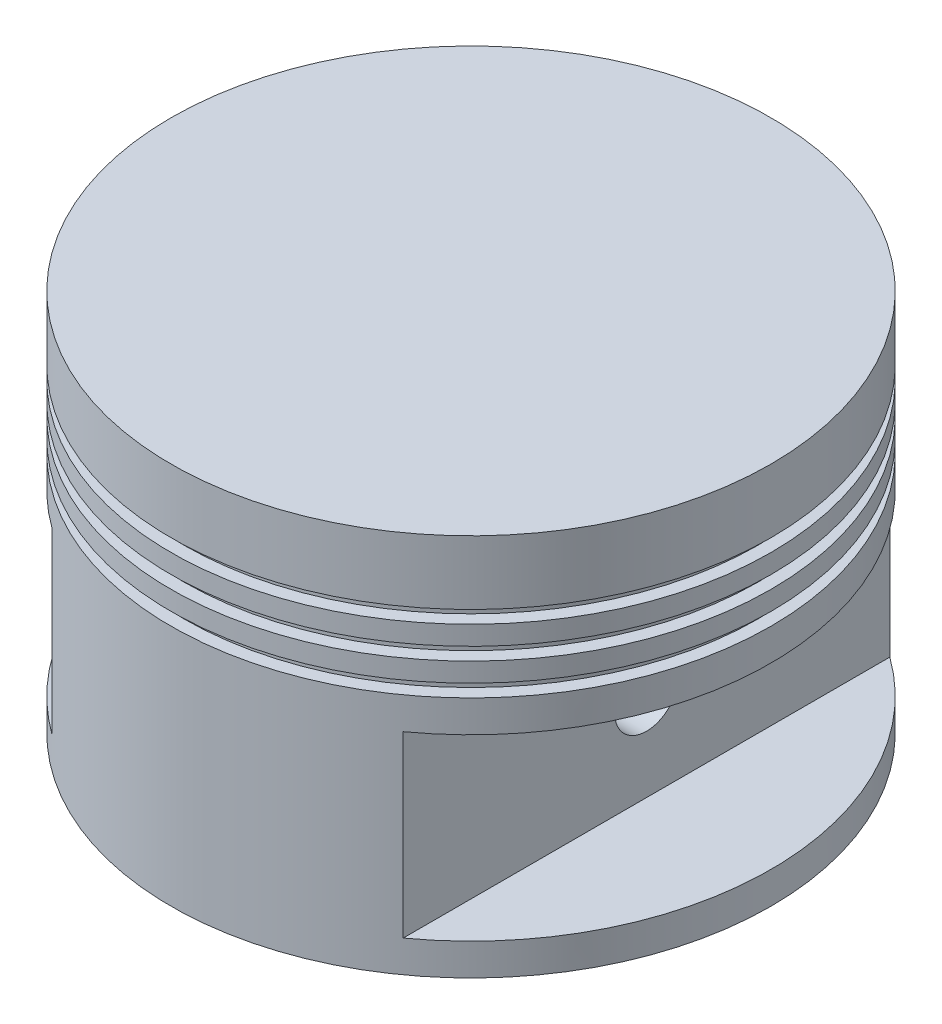
ISO-10303-21;
HEADER;
FILE_DESCRIPTION(('STEP AP214'),'2;1');
FILE_NAME('part.step','',(''),(''),'','','');
FILE_SCHEMA(('AUTOMOTIVE_DESIGN { 1 0 10303 214 1 1 1 1 }'));
ENDSEC;
DATA;
#1=APPLICATION_CONTEXT('core data for automotive mechanical design processes');
#2=APPLICATION_PROTOCOL_DEFINITION('international standard','automotive_design',2000,#1);
#3=PRODUCT_CONTEXT('',#1,'mechanical');
#4=PRODUCT('Part','Part','',(#3));
#5=PRODUCT_RELATED_PRODUCT_CATEGORY('part','',(#4));
#6=PRODUCT_DEFINITION_FORMATION('','',#4);
#7=PRODUCT_DEFINITION_CONTEXT('part definition',#1,'design');
#8=PRODUCT_DEFINITION('design','',#6,#7);
#9=PRODUCT_DEFINITION_SHAPE('','',#8);
#10=(LENGTH_UNIT() NAMED_UNIT(*) SI_UNIT(.MILLI.,.METRE.));
#11=(NAMED_UNIT(*) PLANE_ANGLE_UNIT() SI_UNIT($,.RADIAN.));
#12=(NAMED_UNIT(*) SI_UNIT($,.STERADIAN.) SOLID_ANGLE_UNIT());
#13=UNCERTAINTY_MEASURE_WITH_UNIT(LENGTH_MEASURE(1.E-05),#10,'distance_accuracy_value','');
#14=(GEOMETRIC_REPRESENTATION_CONTEXT(3) GLOBAL_UNCERTAINTY_ASSIGNED_CONTEXT((#13)) GLOBAL_UNIT_ASSIGNED_CONTEXT((#10,
#11,#12)) REPRESENTATION_CONTEXT('',''));
#15=CARTESIAN_POINT('',(0.,0.,0.));
#16=DIRECTION('',(0.,0.,1.));
#17=DIRECTION('',(1.,0.,0.));
#18=AXIS2_PLACEMENT_3D('',#15,#16,#17);
#19=CARTESIAN_POINT('',(17.5,0.,-47.));
#20=DIRECTION('',(-1.,0.,0.));
#21=DIRECTION('',(0.,-1.,0.));
#22=AXIS2_PLACEMENT_3D('',#19,#20,#21);
#23=PLANE('',#22);
#24=CARTESIAN_POINT('',(17.5,-41.,0.));
#25=DIRECTION('',(-1.,0.,0.));
#26=DIRECTION('',(0.,-1.,0.));
#27=AXIS2_PLACEMENT_3D('',#24,#25,#26);
#28=CIRCLE('',#27,5.);
#29=CARTESIAN_POINT('',(17.5,-46.,0.));
#30=VERTEX_POINT('',#29);
#31=EDGE_CURVE('E148',#30,#30,#28,.T.);
#32=ORIENTED_EDGE('',*,*,#31,.F.);
#33=EDGE_LOOP('',(#32));
#34=FACE_BOUND('',#33,.T.);
#35=DIRECTION('',(0.,1.,0.));
#36=VECTOR('',#35,1.);
#37=CARTESIAN_POINT('',(17.5,0.,30.3108891324554));
#38=LINE('',#37,#36);
#39=CARTESIAN_POINT('',(17.5,-32.,30.3108891324554));
#40=VERTEX_POINT('',#39);
#41=CARTESIAN_POINT('',(17.5,-18.,30.3108891324554));
#42=VERTEX_POINT('',#41);
#43=EDGE_CURVE('E190',#40,#42,#38,.T.);
#44=ORIENTED_EDGE('',*,*,#43,.T.);
#45=DIRECTION('',(0.,0.,-1.));
#46=VECTOR('',#45,1.);
#47=CARTESIAN_POINT('',(17.5,-18.,-47.));
#48=LINE('',#47,#46);
#49=CARTESIAN_POINT('',(17.5,-18.,-30.3108891324554));
#50=VERTEX_POINT('',#49);
#51=EDGE_CURVE('E56',#42,#50,#48,.T.);
#52=ORIENTED_EDGE('',*,*,#51,.T.);
#53=DIRECTION('',(0.,1.,0.));
#54=VECTOR('',#53,1.);
#55=CARTESIAN_POINT('',(17.5,0.,-30.3108891324554));
#56=LINE('',#55,#54);
#57=CARTESIAN_POINT('',(17.5,-32.,-30.3108891324554));
#58=VERTEX_POINT('',#57);
#59=EDGE_CURVE('E144',#50,#58,#56,.F.);
#60=ORIENTED_EDGE('',*,*,#59,.T.);
#61=DIRECTION('',(0.,0.,1.));
#62=VECTOR('',#61,1.);
#63=CARTESIAN_POINT('',(17.5,-32.,0.));
#64=LINE('',#63,#62);
#65=CARTESIAN_POINT('',(17.5,-32.,-32.5998466254061));
#66=VERTEX_POINT('',#65);
#67=EDGE_CURVE('E183',#66,#58,#64,.T.);
#68=ORIENTED_EDGE('',*,*,#67,.F.);
#69=DIRECTION('',(0.,1.,0.));
#70=VECTOR('',#69,1.);
#71=CARTESIAN_POINT('',(17.5,-65.,-32.5998466254061));
#72=LINE('',#71,#70);
#73=CARTESIAN_POINT('',(17.5,-60.,-32.5998466254061));
#74=VERTEX_POINT('',#73);
#75=EDGE_CURVE('E160',#74,#66,#72,.T.);
#76=ORIENTED_EDGE('',*,*,#75,.F.);
#77=DIRECTION('',(0.,0.,-1.));
#78=VECTOR('',#77,1.);
#79=CARTESIAN_POINT('',(17.5,-60.,-47.));
#80=LINE('',#79,#78);
#81=CARTESIAN_POINT('',(17.5,-60.,32.5998466254061));
#82=VERTEX_POINT('',#81);
#83=EDGE_CURVE('E139',#82,#74,#80,.T.);
#84=ORIENTED_EDGE('',*,*,#83,.F.);
#85=DIRECTION('',(0.,1.,0.));
#86=VECTOR('',#85,1.);
#87=CARTESIAN_POINT('',(17.5,-17.,32.5998466254061));
#88=LINE('',#87,#86);
#89=CARTESIAN_POINT('',(17.5,-32.,32.5998466254061));
#90=VERTEX_POINT('',#89);
#91=EDGE_CURVE('E156',#90,#82,#88,.F.);
#92=ORIENTED_EDGE('',*,*,#91,.F.);
#93=EDGE_CURVE('E181',#40,#90,#64,.T.);
#94=ORIENTED_EDGE('',*,*,#93,.F.);
#95=EDGE_LOOP('',(#44,#52,#60,#68,#76,#84,#92,#94));
#96=FACE_BOUND('',#95,.T.);
#97=ADVANCED_FACE('F40',(#34,#96),#23,.T.);
#98=CARTESIAN_POINT('',(0.,0.,0.));
#99=DIRECTION('',(0.,1.,0.));
#100=DIRECTION('',(-1.,0.,0.));
#101=AXIS2_PLACEMENT_3D('',#98,#99,#100);
#102=CYLINDRICAL_SURFACE('',#101,35.);
#103=CARTESIAN_POINT('',(0.,-18.,0.));
#104=DIRECTION('',(0.,1.,0.));
#105=DIRECTION('',(-1.,0.,0.));
#106=AXIS2_PLACEMENT_3D('',#103,#104,#105);
#107=CIRCLE('',#106,35.);
#108=CARTESIAN_POINT('',(-17.5,-18.,-30.3108891324553));
#109=VERTEX_POINT('',#108);
#110=EDGE_CURVE('E142',#109,#50,#107,.F.);
#111=ORIENTED_EDGE('',*,*,#110,.F.);
#112=DIRECTION('',(0.,1.,0.));
#113=VECTOR('',#112,1.);
#114=CARTESIAN_POINT('',(-17.5,0.,-30.3108891324553));
#115=LINE('',#114,#113);
#116=CARTESIAN_POINT('',(-17.5,-32.,-30.3108891324553));
#117=VERTEX_POINT('',#116);
#118=EDGE_CURVE('E130',#109,#117,#115,.F.);
#119=ORIENTED_EDGE('',*,*,#118,.T.);
#120=CARTESIAN_POINT('',(0.,-32.,0.));
#121=DIRECTION('',(0.,1.,0.));
#122=DIRECTION('',(-1.,0.,0.));
#123=AXIS2_PLACEMENT_3D('',#120,#121,#122);
#124=CIRCLE('',#123,35.);
#125=EDGE_CURVE('E171',#58,#117,#124,.T.);
#126=ORIENTED_EDGE('',*,*,#125,.F.);
#127=ORIENTED_EDGE('',*,*,#59,.F.);
#128=EDGE_LOOP('',(#111,#119,#126,#127));
#129=FACE_BOUND('',#128,.T.);
#130=ADVANCED_FACE('F143',(#129),#102,.F.);
#131=CARTESIAN_POINT('',(-17.5,-18.,30.3108891324553));
#132=VERTEX_POINT('',#131);
#133=EDGE_CURVE('E64',#42,#132,#107,.F.);
#134=ORIENTED_EDGE('',*,*,#133,.F.);
#135=ORIENTED_EDGE('',*,*,#43,.F.);
#136=CARTESIAN_POINT('',(-17.5,-32.,30.3108891324553));
#137=VERTEX_POINT('',#136);
#138=EDGE_CURVE('E174',#137,#40,#124,.T.);
#139=ORIENTED_EDGE('',*,*,#138,.F.);
#140=DIRECTION('',(0.,1.,0.));
#141=VECTOR('',#140,1.);
#142=CARTESIAN_POINT('',(-17.5,0.,30.3108891324553));
#143=LINE('',#142,#141);
#144=EDGE_CURVE('E138',#137,#132,#143,.T.);
#145=ORIENTED_EDGE('',*,*,#144,.T.);
#146=EDGE_LOOP('',(#134,#135,#139,#145));
#147=FACE_BOUND('',#146,.T.);
#148=ADVANCED_FACE('F297',(#147),#102,.F.);
#149=CARTESIAN_POINT('',(-17.5,0.,-47.));
#150=DIRECTION('',(-1.,0.,0.));
#151=DIRECTION('',(0.,-1.,0.));
#152=AXIS2_PLACEMENT_3D('',#149,#150,#151);
#153=PLANE('',#152);
#154=CARTESIAN_POINT('',(-17.5,-41.,0.));
#155=DIRECTION('',(-1.,0.,0.));
#156=DIRECTION('',(0.,-1.,0.));
#157=AXIS2_PLACEMENT_3D('',#154,#155,#156);
#158=CIRCLE('',#157,5.);
#159=CARTESIAN_POINT('',(-17.5,-46.,0.));
#160=VERTEX_POINT('',#159);
#161=EDGE_CURVE('E150',#160,#160,#158,.T.);
#162=ORIENTED_EDGE('',*,*,#161,.T.);
#163=EDGE_LOOP('',(#162));
#164=FACE_BOUND('',#163,.T.);
#165=DIRECTION('',(0.,0.,-1.));
#166=VECTOR('',#165,1.);
#167=CARTESIAN_POINT('',(-17.5,-18.,-47.));
#168=LINE('',#167,#166);
#169=EDGE_CURVE('E12',#132,#109,#168,.T.);
#170=ORIENTED_EDGE('',*,*,#169,.F.);
#171=ORIENTED_EDGE('',*,*,#144,.F.);
#172=DIRECTION('',(0.,0.,1.));
#173=VECTOR('',#172,1.);
#174=CARTESIAN_POINT('',(-17.5,-32.,0.));
#175=LINE('',#174,#173);
#176=CARTESIAN_POINT('',(-17.5,-32.,32.5998466254061));
#177=VERTEX_POINT('',#176);
#178=EDGE_CURVE('E184',#137,#177,#175,.T.);
#179=ORIENTED_EDGE('',*,*,#178,.T.);
#180=DIRECTION('',(0.,1.,0.));
#181=VECTOR('',#180,1.);
#182=CARTESIAN_POINT('',(-17.5,-17.,32.5998466254061));
#183=LINE('',#182,#181);
#184=CARTESIAN_POINT('',(-17.5,-60.,32.5998466254061));
#185=VERTEX_POINT('',#184);
#186=EDGE_CURVE('E163',#177,#185,#183,.F.);
#187=ORIENTED_EDGE('',*,*,#186,.T.);
#188=DIRECTION('',(0.,0.,-1.));
#189=VECTOR('',#188,1.);
#190=CARTESIAN_POINT('',(-17.5,-60.,-47.));
#191=LINE('',#190,#189);
#192=CARTESIAN_POINT('',(-17.5,-60.,-32.5998466254061));
#193=VERTEX_POINT('',#192);
#194=EDGE_CURVE('E159',#185,#193,#191,.T.);
#195=ORIENTED_EDGE('',*,*,#194,.T.);
#196=DIRECTION('',(0.,1.,0.));
#197=VECTOR('',#196,1.);
#198=CARTESIAN_POINT('',(-17.5,-65.,-32.5998466254061));
#199=LINE('',#198,#197);
#200=CARTESIAN_POINT('',(-17.5,-32.,-32.5998466254061));
#201=VERTEX_POINT('',#200);
#202=EDGE_CURVE('E169',#193,#201,#199,.T.);
#203=ORIENTED_EDGE('',*,*,#202,.T.);
#204=EDGE_CURVE('E134',#201,#117,#175,.T.);
#205=ORIENTED_EDGE('',*,*,#204,.T.);
#206=ORIENTED_EDGE('',*,*,#118,.F.);
#207=EDGE_LOOP('',(#170,#171,#179,#187,#195,#203,#205,#206));
#208=FACE_BOUND('',#207,.T.);
#209=ADVANCED_FACE('F132',(#164,#208),#153,.F.);
#210=CARTESIAN_POINT('',(0.,0.,0.));
#211=DIRECTION('',(0.,1.,0.));
#212=DIRECTION('',(-1.,0.,0.));
#213=AXIS2_PLACEMENT_3D('',#210,#211,#212);
#214=CYLINDRICAL_SURFACE('',#213,47.);
#215=DIRECTION('',(0.,1.,0.));
#216=VECTOR('',#215,1.);
#217=CARTESIAN_POINT('',(27.5,0.,38.1149576937979));
#218=LINE('',#217,#216);
#219=CARTESIAN_POINT('',(27.5,-27.,38.1149576937979));
#220=VERTEX_POINT('',#219);
#221=CARTESIAN_POINT('',(27.5,-55.,38.1149576937979));
#222=VERTEX_POINT('',#221);
#223=EDGE_CURVE('E49',#220,#222,#218,.F.);
#224=ORIENTED_EDGE('',*,*,#223,.F.);
#225=CARTESIAN_POINT('',(0.,-27.,0.));
#226=DIRECTION('',(0.,-1.,0.));
#227=DIRECTION('',(1.,0.,0.));
#228=AXIS2_PLACEMENT_3D('',#225,#226,#227);
#229=CIRCLE('',#228,47.);
#230=CARTESIAN_POINT('',(27.5,-27.,-38.1149576937979));
#231=VERTEX_POINT('',#230);
#232=EDGE_CURVE('E262',#220,#231,#229,.F.);
#233=ORIENTED_EDGE('',*,*,#232,.T.);
#234=DIRECTION('',(0.,1.,0.));
#235=VECTOR('',#234,1.);
#236=CARTESIAN_POINT('',(27.5,0.,-38.1149576937979));
#237=LINE('',#236,#235);
#238=CARTESIAN_POINT('',(27.5,-55.,-38.1149576937979));
#239=VERTEX_POINT('',#238);
#240=EDGE_CURVE('E257',#239,#231,#237,.T.);
#241=ORIENTED_EDGE('',*,*,#240,.F.);
#242=CARTESIAN_POINT('',(0.,-55.,0.));
#243=DIRECTION('',(0.,-1.,0.));
#244=DIRECTION('',(0.,0.,-1.));
#245=AXIS2_PLACEMENT_3D('',#242,#243,#244);
#246=CIRCLE('',#245,47.);
#247=EDGE_CURVE('E259',#222,#239,#246,.F.);
#248=ORIENTED_EDGE('',*,*,#247,.F.);
#249=EDGE_LOOP('',(#224,#233,#241,#248));
#250=FACE_BOUND('',#249,.T.);
#251=CARTESIAN_POINT('',(0.,-60.,0.));
#252=DIRECTION('',(0.,1.,0.));
#253=DIRECTION('',(-1.,0.,0.));
#254=AXIS2_PLACEMENT_3D('',#251,#252,#253);
#255=CIRCLE('',#254,47.);
#256=CARTESIAN_POINT('',(-47.,-60.,0.));
#257=VERTEX_POINT('',#256);
#258=EDGE_CURVE('E237',#257,#257,#255,.T.);
#259=ORIENTED_EDGE('',*,*,#258,.T.);
#260=EDGE_LOOP('',(#259));
#261=FACE_BOUND('',#260,.T.);
#262=CARTESIAN_POINT('',(0.,-22.,0.));
#263=DIRECTION('',(0.,1.,0.));
#264=DIRECTION('',(-1.,0.,0.));
#265=AXIS2_PLACEMENT_3D('',#262,#263,#264);
#266=CIRCLE('',#265,47.);
#267=CARTESIAN_POINT('',(-47.,-22.,0.));
#268=VERTEX_POINT('',#267);
#269=EDGE_CURVE('E240',#268,#268,#266,.T.);
#270=ORIENTED_EDGE('',*,*,#269,.F.);
#271=EDGE_LOOP('',(#270));
#272=FACE_BOUND('',#271,.T.);
#273=DIRECTION('',(0.,1.,0.));
#274=VECTOR('',#273,1.);
#275=CARTESIAN_POINT('',(-27.5,0.,-38.1149576937979));
#276=LINE('',#275,#274);
#277=CARTESIAN_POINT('',(-27.5,-55.,-38.1149576937979));
#278=VERTEX_POINT('',#277);
#279=CARTESIAN_POINT('',(-27.5,-27.,-38.1149576937979));
#280=VERTEX_POINT('',#279);
#281=EDGE_CURVE('E248',#278,#280,#276,.T.);
#282=ORIENTED_EDGE('',*,*,#281,.T.);
#283=CARTESIAN_POINT('',(0.,-27.,0.));
#284=DIRECTION('',(0.,-1.,0.));
#285=DIRECTION('',(1.,0.,0.));
#286=AXIS2_PLACEMENT_3D('',#283,#284,#285);
#287=CIRCLE('',#286,47.);
#288=CARTESIAN_POINT('',(-27.5,-27.,38.1149576937979));
#289=VERTEX_POINT('',#288);
#290=EDGE_CURVE('E254',#280,#289,#287,.F.);
#291=ORIENTED_EDGE('',*,*,#290,.T.);
#292=DIRECTION('',(0.,1.,0.));
#293=VECTOR('',#292,1.);
#294=CARTESIAN_POINT('',(-27.5,0.,38.1149576937979));
#295=LINE('',#294,#293);
#296=CARTESIAN_POINT('',(-27.5,-55.,38.1149576937979));
#297=VERTEX_POINT('',#296);
#298=EDGE_CURVE('E251',#289,#297,#295,.F.);
#299=ORIENTED_EDGE('',*,*,#298,.T.);
#300=CARTESIAN_POINT('',(0.,-55.,0.));
#301=DIRECTION('',(0.,-1.,0.));
#302=DIRECTION('',(0.,0.,-1.));
#303=AXIS2_PLACEMENT_3D('',#300,#301,#302);
#304=CIRCLE('',#303,47.);
#305=EDGE_CURVE('E246',#278,#297,#304,.F.);
#306=ORIENTED_EDGE('',*,*,#305,.F.);
#307=EDGE_LOOP('',(#282,#291,#299,#306));
#308=FACE_BOUND('',#307,.T.);
#309=ADVANCED_FACE('F274',(#250,#261,#272,#308),#214,.T.);
#310=CARTESIAN_POINT('',(0.,0.,0.));
#311=DIRECTION('',(0.,1.,0.));
#312=DIRECTION('',(-1.,0.,0.));
#313=AXIS2_PLACEMENT_3D('',#310,#311,#312);
#314=CYLINDRICAL_SURFACE('',#313,45.);
#315=CARTESIAN_POINT('',(0.,-22.,0.));
#316=DIRECTION('',(0.,1.,0.));
#317=DIRECTION('',(-1.,0.,0.));
#318=AXIS2_PLACEMENT_3D('',#315,#316,#317);
#319=CIRCLE('',#318,45.);
#320=CARTESIAN_POINT('',(-45.,-22.,0.));
#321=VERTEX_POINT('',#320);
#322=EDGE_CURVE('E243',#321,#321,#319,.T.);
#323=ORIENTED_EDGE('',*,*,#322,.T.);
#324=EDGE_LOOP('',(#323));
#325=FACE_BOUND('',#324,.T.);
#326=CARTESIAN_POINT('',(0.,-20.,0.));
#327=DIRECTION('',(0.,1.,0.));
#328=DIRECTION('',(-1.,0.,0.));
#329=AXIS2_PLACEMENT_3D('',#326,#327,#328);
#330=CIRCLE('',#329,45.);
#331=CARTESIAN_POINT('',(-45.,-20.,0.));
#332=VERTEX_POINT('',#331);
#333=EDGE_CURVE('E202',#332,#332,#330,.T.);
#334=ORIENTED_EDGE('',*,*,#333,.F.);
#335=EDGE_LOOP('',(#334));
#336=FACE_BOUND('',#335,.T.);
#337=ADVANCED_FACE('F42',(#325,#336),#314,.T.);
#338=CARTESIAN_POINT('',(0.,-22.,0.));
#339=DIRECTION('',(0.,1.,0.));
#340=DIRECTION('',(-1.,0.,0.));
#341=AXIS2_PLACEMENT_3D('',#338,#339,#340);
#342=PLANE('',#341);
#343=ORIENTED_EDGE('',*,*,#269,.T.);
#344=EDGE_LOOP('',(#343));
#345=FACE_BOUND('',#344,.T.);
#346=ORIENTED_EDGE('',*,*,#322,.F.);
#347=EDGE_LOOP('',(#346));
#348=FACE_BOUND('',#347,.T.);
#349=ADVANCED_FACE('F468',(#345,#348),#342,.T.);
#350=CARTESIAN_POINT('',(0.,-60.,0.));
#351=DIRECTION('',(0.,1.,0.));
#352=DIRECTION('',(-1.,0.,0.));
#353=AXIS2_PLACEMENT_3D('',#350,#351,#352);
#354=PLANE('',#353);
#355=CARTESIAN_POINT('',(0.,-60.,0.));
#356=DIRECTION('',(0.,1.,0.));
#357=DIRECTION('',(-1.,0.,0.));
#358=AXIS2_PLACEMENT_3D('',#355,#356,#357);
#359=CIRCLE('',#358,37.);
#360=EDGE_CURVE('E155',#185,#82,#359,.T.);
#361=ORIENTED_EDGE('',*,*,#360,.T.);
#362=ORIENTED_EDGE('',*,*,#83,.T.);
#363=EDGE_CURVE('E168',#74,#193,#359,.T.);
#364=ORIENTED_EDGE('',*,*,#363,.T.);
#365=ORIENTED_EDGE('',*,*,#194,.F.);
#366=EDGE_LOOP('',(#361,#362,#364,#365));
#367=FACE_BOUND('',#366,.T.);
#368=ORIENTED_EDGE('',*,*,#258,.F.);
#369=EDGE_LOOP('',(#368));
#370=FACE_BOUND('',#369,.T.);
#371=ADVANCED_FACE('F350',(#367,#370),#354,.F.);
#372=CARTESIAN_POINT('',(0.,0.,0.));
#373=DIRECTION('',(0.,1.,0.));
#374=DIRECTION('',(-1.,0.,0.));
#375=AXIS2_PLACEMENT_3D('',#372,#373,#374);
#376=PLANE('',#375);
#377=CARTESIAN_POINT('',(0.,0.,0.));
#378=DIRECTION('',(0.,1.,0.));
#379=DIRECTION('',(-1.,0.,0.));
#380=AXIS2_PLACEMENT_3D('',#377,#378,#379);
#381=CIRCLE('',#380,47.);
#382=CARTESIAN_POINT('',(-47.,0.,0.));
#383=VERTEX_POINT('',#382);
#384=EDGE_CURVE('E234',#383,#383,#381,.T.);
#385=ORIENTED_EDGE('',*,*,#384,.T.);
#386=EDGE_LOOP('',(#385));
#387=FACE_BOUND('',#386,.T.);
#388=ADVANCED_FACE('F393',(#387),#376,.T.);
#389=CARTESIAN_POINT('',(0.,0.,0.));
#390=DIRECTION('',(0.,1.,0.));
#391=DIRECTION('',(-1.,0.,0.));
#392=AXIS2_PLACEMENT_3D('',#389,#390,#391);
#393=CYLINDRICAL_SURFACE('',#392,47.);
#394=CARTESIAN_POINT('',(0.,-10.,0.));
#395=DIRECTION('',(0.,1.,0.));
#396=DIRECTION('',(-1.,0.,0.));
#397=AXIS2_PLACEMENT_3D('',#394,#395,#396);
#398=CIRCLE('',#397,47.);
#399=CARTESIAN_POINT('',(-47.,-10.,0.));
#400=VERTEX_POINT('',#399);
#401=EDGE_CURVE('E231',#400,#400,#398,.T.);
#402=ORIENTED_EDGE('',*,*,#401,.T.);
#403=EDGE_LOOP('',(#402));
#404=FACE_BOUND('',#403,.T.);
#405=ORIENTED_EDGE('',*,*,#384,.F.);
#406=EDGE_LOOP('',(#405));
#407=FACE_BOUND('',#406,.T.);
#408=ADVANCED_FACE('F399',(#404,#407),#393,.T.);
#409=CARTESIAN_POINT('',(0.,-10.,0.));
#410=DIRECTION('',(0.,1.,0.));
#411=DIRECTION('',(-1.,0.,0.));
#412=AXIS2_PLACEMENT_3D('',#409,#410,#411);
#413=PLANE('',#412);
#414=ORIENTED_EDGE('',*,*,#401,.F.);
#415=EDGE_LOOP('',(#414));
#416=FACE_BOUND('',#415,.T.);
#417=CARTESIAN_POINT('',(0.,-10.,0.));
#418=DIRECTION('',(0.,1.,0.));
#419=DIRECTION('',(-1.,0.,0.));
#420=AXIS2_PLACEMENT_3D('',#417,#418,#419);
#421=CIRCLE('',#420,45.);
#422=CARTESIAN_POINT('',(-45.,-10.,0.));
#423=VERTEX_POINT('',#422);
#424=EDGE_CURVE('E228',#423,#423,#421,.T.);
#425=ORIENTED_EDGE('',*,*,#424,.T.);
#426=EDGE_LOOP('',(#425));
#427=FACE_BOUND('',#426,.T.);
#428=ADVANCED_FACE('F488',(#416,#427),#413,.F.);
#429=CARTESIAN_POINT('',(0.,0.,0.));
#430=DIRECTION('',(0.,1.,0.));
#431=DIRECTION('',(-1.,0.,0.));
#432=AXIS2_PLACEMENT_3D('',#429,#430,#431);
#433=CYLINDRICAL_SURFACE('',#432,45.);
#434=CARTESIAN_POINT('',(0.,-12.,0.));
#435=DIRECTION('',(0.,1.,0.));
#436=DIRECTION('',(-1.,0.,0.));
#437=AXIS2_PLACEMENT_3D('',#434,#435,#436);
#438=CIRCLE('',#437,45.);
#439=CARTESIAN_POINT('',(-45.,-12.,0.));
#440=VERTEX_POINT('',#439);
#441=EDGE_CURVE('E225',#440,#440,#438,.T.);
#442=ORIENTED_EDGE('',*,*,#441,.T.);
#443=EDGE_LOOP('',(#442));
#444=FACE_BOUND('',#443,.T.);
#445=ORIENTED_EDGE('',*,*,#424,.F.);
#446=EDGE_LOOP('',(#445));
#447=FACE_BOUND('',#446,.T.);
#448=ADVANCED_FACE('F497',(#444,#447),#433,.T.);
#449=CARTESIAN_POINT('',(0.,-12.,0.));
#450=DIRECTION('',(0.,1.,0.));
#451=DIRECTION('',(-1.,0.,0.));
#452=AXIS2_PLACEMENT_3D('',#449,#450,#451);
#453=PLANE('',#452);
#454=CARTESIAN_POINT('',(0.,-12.,0.));
#455=DIRECTION('',(0.,1.,0.));
#456=DIRECTION('',(-1.,0.,0.));
#457=AXIS2_PLACEMENT_3D('',#454,#455,#456);
#458=CIRCLE('',#457,47.);
#459=CARTESIAN_POINT('',(-47.,-12.,0.));
#460=VERTEX_POINT('',#459);
#461=EDGE_CURVE('E222',#460,#460,#458,.T.);
#462=ORIENTED_EDGE('',*,*,#461,.T.);
#463=EDGE_LOOP('',(#462));
#464=FACE_BOUND('',#463,.T.);
#465=ORIENTED_EDGE('',*,*,#441,.F.);
#466=EDGE_LOOP('',(#465));
#467=FACE_BOUND('',#466,.T.);
#468=ADVANCED_FACE('F505',(#464,#467),#453,.T.);
#469=CARTESIAN_POINT('',(0.,0.,0.));
#470=DIRECTION('',(0.,1.,0.));
#471=DIRECTION('',(-1.,0.,0.));
#472=AXIS2_PLACEMENT_3D('',#469,#470,#471);
#473=CYLINDRICAL_SURFACE('',#472,47.);
#474=CARTESIAN_POINT('',(0.,-15.,0.));
#475=DIRECTION('',(0.,1.,0.));
#476=DIRECTION('',(-1.,0.,0.));
#477=AXIS2_PLACEMENT_3D('',#474,#475,#476);
#478=CIRCLE('',#477,47.);
#479=CARTESIAN_POINT('',(-47.,-15.,0.));
#480=VERTEX_POINT('',#479);
#481=EDGE_CURVE('E219',#480,#480,#478,.T.);
#482=ORIENTED_EDGE('',*,*,#481,.T.);
#483=EDGE_LOOP('',(#482));
#484=FACE_BOUND('',#483,.T.);
#485=ORIENTED_EDGE('',*,*,#461,.F.);
#486=EDGE_LOOP('',(#485));
#487=FACE_BOUND('',#486,.T.);
#488=ADVANCED_FACE('F513',(#484,#487),#473,.T.);
#489=CARTESIAN_POINT('',(0.,-15.,0.));
#490=DIRECTION('',(0.,1.,0.));
#491=DIRECTION('',(-1.,0.,0.));
#492=AXIS2_PLACEMENT_3D('',#489,#490,#491);
#493=PLANE('',#492);
#494=ORIENTED_EDGE('',*,*,#481,.F.);
#495=EDGE_LOOP('',(#494));
#496=FACE_BOUND('',#495,.T.);
#497=CARTESIAN_POINT('',(0.,-15.,0.));
#498=DIRECTION('',(0.,1.,0.));
#499=DIRECTION('',(-1.,0.,0.));
#500=AXIS2_PLACEMENT_3D('',#497,#498,#499);
#501=CIRCLE('',#500,45.);
#502=CARTESIAN_POINT('',(-45.,-15.,0.));
#503=VERTEX_POINT('',#502);
#504=EDGE_CURVE('E216',#503,#503,#501,.T.);
#505=ORIENTED_EDGE('',*,*,#504,.T.);
#506=EDGE_LOOP('',(#505));
#507=FACE_BOUND('',#506,.T.);
#508=ADVANCED_FACE('F521',(#496,#507),#493,.F.);
#509=CARTESIAN_POINT('',(0.,0.,0.));
#510=DIRECTION('',(0.,1.,0.));
#511=DIRECTION('',(-1.,0.,0.));
#512=AXIS2_PLACEMENT_3D('',#509,#510,#511);
#513=CYLINDRICAL_SURFACE('',#512,45.);
#514=CARTESIAN_POINT('',(0.,-17.,0.));
#515=DIRECTION('',(0.,1.,0.));
#516=DIRECTION('',(-1.,0.,0.));
#517=AXIS2_PLACEMENT_3D('',#514,#515,#516);
#518=CIRCLE('',#517,45.);
#519=CARTESIAN_POINT('',(-45.,-17.,0.));
#520=VERTEX_POINT('',#519);
#521=EDGE_CURVE('E213',#520,#520,#518,.T.);
#522=ORIENTED_EDGE('',*,*,#521,.T.);
#523=EDGE_LOOP('',(#522));
#524=FACE_BOUND('',#523,.T.);
#525=ORIENTED_EDGE('',*,*,#504,.F.);
#526=EDGE_LOOP('',(#525));
#527=FACE_BOUND('',#526,.T.);
#528=ADVANCED_FACE('F529',(#524,#527),#513,.T.);
#529=CARTESIAN_POINT('',(0.,-17.,0.));
#530=DIRECTION('',(0.,1.,0.));
#531=DIRECTION('',(-1.,0.,0.));
#532=AXIS2_PLACEMENT_3D('',#529,#530,#531);
#533=PLANE('',#532);
#534=CARTESIAN_POINT('',(0.,-17.,0.));
#535=DIRECTION('',(0.,1.,0.));
#536=DIRECTION('',(-1.,0.,0.));
#537=AXIS2_PLACEMENT_3D('',#534,#535,#536);
#538=CIRCLE('',#537,47.);
#539=CARTESIAN_POINT('',(-47.,-17.,0.));
#540=VERTEX_POINT('',#539);
#541=EDGE_CURVE('E210',#540,#540,#538,.T.);
#542=ORIENTED_EDGE('',*,*,#541,.T.);
#543=EDGE_LOOP('',(#542));
#544=FACE_BOUND('',#543,.T.);
#545=ORIENTED_EDGE('',*,*,#521,.F.);
#546=EDGE_LOOP('',(#545));
#547=FACE_BOUND('',#546,.T.);
#548=ADVANCED_FACE('F537',(#544,#547),#533,.T.);
#549=CARTESIAN_POINT('',(0.,0.,0.));
#550=DIRECTION('',(0.,1.,0.));
#551=DIRECTION('',(-1.,0.,0.));
#552=AXIS2_PLACEMENT_3D('',#549,#550,#551);
#553=CYLINDRICAL_SURFACE('',#552,47.);
#554=CARTESIAN_POINT('',(0.,-20.,0.));
#555=DIRECTION('',(0.,1.,0.));
#556=DIRECTION('',(-1.,0.,0.));
#557=AXIS2_PLACEMENT_3D('',#554,#555,#556);
#558=CIRCLE('',#557,47.);
#559=CARTESIAN_POINT('',(-47.,-20.,0.));
#560=VERTEX_POINT('',#559);
#561=EDGE_CURVE('E207',#560,#560,#558,.T.);
#562=ORIENTED_EDGE('',*,*,#561,.T.);
#563=EDGE_LOOP('',(#562));
#564=FACE_BOUND('',#563,.T.);
#565=ORIENTED_EDGE('',*,*,#541,.F.);
#566=EDGE_LOOP('',(#565));
#567=FACE_BOUND('',#566,.T.);
#568=ADVANCED_FACE('F545',(#564,#567),#553,.T.);
#569=CARTESIAN_POINT('',(0.,-20.,0.));
#570=DIRECTION('',(0.,1.,0.));
#571=DIRECTION('',(-1.,0.,0.));
#572=AXIS2_PLACEMENT_3D('',#569,#570,#571);
#573=PLANE('',#572);
#574=ORIENTED_EDGE('',*,*,#561,.F.);
#575=EDGE_LOOP('',(#574));
#576=FACE_BOUND('',#575,.T.);
#577=ORIENTED_EDGE('',*,*,#333,.T.);
#578=EDGE_LOOP('',(#577));
#579=FACE_BOUND('',#578,.T.);
#580=ADVANCED_FACE('F553',(#576,#579),#573,.F.);
#581=CARTESIAN_POINT('',(0.,-27.,-47.));
#582=DIRECTION('',(0.,-1.,0.));
#583=DIRECTION('',(1.,0.,0.));
#584=AXIS2_PLACEMENT_3D('',#581,#582,#583);
#585=PLANE('',#584);
#586=DIRECTION('',(0.,0.,1.));
#587=VECTOR('',#586,1.);
#588=CARTESIAN_POINT('',(-27.5,-27.,-47.));
#589=LINE('',#588,#587);
#590=EDGE_CURVE('E199',#280,#289,#589,.T.);
#591=ORIENTED_EDGE('',*,*,#590,.T.);
#592=ORIENTED_EDGE('',*,*,#290,.F.);
#593=EDGE_LOOP('',(#591,#592));
#594=FACE_BOUND('',#593,.T.);
#595=ADVANCED_FACE('F429',(#594),#585,.T.);
#596=CARTESIAN_POINT('',(-27.5,0.,-47.));
#597=DIRECTION('',(-1.,0.,0.));
#598=DIRECTION('',(0.,-1.,0.));
#599=AXIS2_PLACEMENT_3D('',#596,#597,#598);
#600=PLANE('',#599);
#601=CARTESIAN_POINT('',(-27.5,-41.,0.));
#602=DIRECTION('',(-1.,0.,0.));
#603=DIRECTION('',(0.,-1.,0.));
#604=AXIS2_PLACEMENT_3D('',#601,#602,#603);
#605=CIRCLE('',#604,5.);
#606=CARTESIAN_POINT('',(-27.5,-46.,0.));
#607=VERTEX_POINT('',#606);
#608=EDGE_CURVE('E314',#607,#607,#605,.T.);
#609=ORIENTED_EDGE('',*,*,#608,.F.);
#610=EDGE_LOOP('',(#609));
#611=FACE_BOUND('',#610,.T.);
#612=ORIENTED_EDGE('',*,*,#590,.F.);
#613=ORIENTED_EDGE('',*,*,#281,.F.);
#614=DIRECTION('',(0.,0.,1.));
#615=VECTOR('',#614,1.);
#616=CARTESIAN_POINT('',(-27.5,-55.,-47.));
#617=LINE('',#616,#615);
#618=EDGE_CURVE('E196',#278,#297,#617,.T.);
#619=ORIENTED_EDGE('',*,*,#618,.T.);
#620=ORIENTED_EDGE('',*,*,#298,.F.);
#621=EDGE_LOOP('',(#612,#613,#619,#620));
#622=FACE_BOUND('',#621,.T.);
#623=ADVANCED_FACE('F286',(#611,#622),#600,.T.);
#624=CARTESIAN_POINT('',(0.,-55.,-47.));
#625=DIRECTION('',(0.,-1.,0.));
#626=DIRECTION('',(0.,0.,-1.));
#627=AXIS2_PLACEMENT_3D('',#624,#625,#626);
#628=PLANE('',#627);
#629=ORIENTED_EDGE('',*,*,#305,.T.);
#630=ORIENTED_EDGE('',*,*,#618,.F.);
#631=EDGE_LOOP('',(#629,#630));
#632=FACE_BOUND('',#631,.T.);
#633=ADVANCED_FACE('F279',(#632),#628,.F.);
#634=CARTESIAN_POINT('',(0.,-27.,-47.));
#635=DIRECTION('',(0.,-1.,0.));
#636=DIRECTION('',(1.,0.,0.));
#637=AXIS2_PLACEMENT_3D('',#634,#635,#636);
#638=PLANE('',#637);
#639=DIRECTION('',(0.,0.,1.));
#640=VECTOR('',#639,1.);
#641=CARTESIAN_POINT('',(27.5,-27.,-47.));
#642=LINE('',#641,#640);
#643=EDGE_CURVE('E192',#231,#220,#642,.T.);
#644=ORIENTED_EDGE('',*,*,#643,.F.);
#645=ORIENTED_EDGE('',*,*,#232,.F.);
#646=EDGE_LOOP('',(#644,#645));
#647=FACE_BOUND('',#646,.T.);
#648=ADVANCED_FACE('F277',(#647),#638,.T.);
#649=CARTESIAN_POINT('',(0.,-55.,-47.));
#650=DIRECTION('',(0.,-1.,0.));
#651=DIRECTION('',(0.,0.,-1.));
#652=AXIS2_PLACEMENT_3D('',#649,#650,#651);
#653=PLANE('',#652);
#654=ORIENTED_EDGE('',*,*,#247,.T.);
#655=DIRECTION('',(0.,0.,1.));
#656=VECTOR('',#655,1.);
#657=CARTESIAN_POINT('',(27.5,-55.,-47.));
#658=LINE('',#657,#656);
#659=EDGE_CURVE('E193',#239,#222,#658,.T.);
#660=ORIENTED_EDGE('',*,*,#659,.T.);
#661=EDGE_LOOP('',(#654,#660));
#662=FACE_BOUND('',#661,.T.);
#663=ADVANCED_FACE('F272',(#662),#653,.F.);
#664=CARTESIAN_POINT('',(27.5,0.,-47.));
#665=DIRECTION('',(-1.,0.,0.));
#666=DIRECTION('',(0.,-1.,0.));
#667=AXIS2_PLACEMENT_3D('',#664,#665,#666);
#668=PLANE('',#667);
#669=CARTESIAN_POINT('',(27.5,-41.,0.));
#670=DIRECTION('',(-1.,0.,0.));
#671=DIRECTION('',(0.,-1.,0.));
#672=AXIS2_PLACEMENT_3D('',#669,#670,#671);
#673=CIRCLE('',#672,5.);
#674=CARTESIAN_POINT('',(27.5,-46.,0.));
#675=VERTEX_POINT('',#674);
#676=EDGE_CURVE('E44',#675,#675,#673,.T.);
#677=ORIENTED_EDGE('',*,*,#676,.T.);
#678=EDGE_LOOP('',(#677));
#679=FACE_BOUND('',#678,.T.);
#680=ORIENTED_EDGE('',*,*,#223,.T.);
#681=ORIENTED_EDGE('',*,*,#659,.F.);
#682=ORIENTED_EDGE('',*,*,#240,.T.);
#683=ORIENTED_EDGE('',*,*,#643,.T.);
#684=EDGE_LOOP('',(#680,#681,#682,#683));
#685=FACE_BOUND('',#684,.T.);
#686=ADVANCED_FACE('F267',(#679,#685),#668,.F.);
#687=CARTESIAN_POINT('',(0.,-32.,0.));
#688=DIRECTION('',(0.,1.,0.));
#689=DIRECTION('',(-1.,0.,0.));
#690=AXIS2_PLACEMENT_3D('',#687,#688,#689);
#691=PLANE('',#690);
#692=CARTESIAN_POINT('',(0.,-32.,0.));
#693=DIRECTION('',(0.,1.,0.));
#694=DIRECTION('',(-1.,0.,0.));
#695=AXIS2_PLACEMENT_3D('',#692,#693,#694);
#696=CIRCLE('',#695,37.);
#697=EDGE_CURVE('E167',#66,#201,#696,.T.);
#698=ORIENTED_EDGE('',*,*,#697,.F.);
#699=ORIENTED_EDGE('',*,*,#67,.T.);
#700=ORIENTED_EDGE('',*,*,#125,.T.);
#701=ORIENTED_EDGE('',*,*,#204,.F.);
#702=EDGE_LOOP('',(#698,#699,#700,#701));
#703=FACE_BOUND('',#702,.T.);
#704=ADVANCED_FACE('F303',(#703),#691,.F.);
#705=CARTESIAN_POINT('',(0.,0.,0.));
#706=DIRECTION('',(0.,1.,0.));
#707=DIRECTION('',(-1.,0.,0.));
#708=AXIS2_PLACEMENT_3D('',#705,#706,#707);
#709=CYLINDRICAL_SURFACE('',#708,37.);
#710=ORIENTED_EDGE('',*,*,#363,.F.);
#711=ORIENTED_EDGE('',*,*,#75,.T.);
#712=ORIENTED_EDGE('',*,*,#697,.T.);
#713=ORIENTED_EDGE('',*,*,#202,.F.);
#714=EDGE_LOOP('',(#710,#711,#712,#713));
#715=FACE_BOUND('',#714,.T.);
#716=ADVANCED_FACE('F308',(#715),#709,.F.);
#717=ORIENTED_EDGE('',*,*,#186,.F.);
#718=EDGE_CURVE('E164',#177,#90,#696,.T.);
#719=ORIENTED_EDGE('',*,*,#718,.T.);
#720=ORIENTED_EDGE('',*,*,#91,.T.);
#721=ORIENTED_EDGE('',*,*,#360,.F.);
#722=EDGE_LOOP('',(#717,#719,#720,#721));
#723=FACE_BOUND('',#722,.T.);
#724=ADVANCED_FACE('F334',(#723),#709,.F.);
#725=ORIENTED_EDGE('',*,*,#138,.T.);
#726=ORIENTED_EDGE('',*,*,#93,.T.);
#727=ORIENTED_EDGE('',*,*,#718,.F.);
#728=ORIENTED_EDGE('',*,*,#178,.F.);
#729=EDGE_LOOP('',(#725,#726,#727,#728));
#730=FACE_BOUND('',#729,.T.);
#731=ADVANCED_FACE('F310',(#730),#691,.F.);
#732=CARTESIAN_POINT('',(0.,-18.,0.));
#733=DIRECTION('',(0.,1.,0.));
#734=DIRECTION('',(-1.,0.,0.));
#735=AXIS2_PLACEMENT_3D('',#732,#733,#734);
#736=PLANE('',#735);
#737=ORIENTED_EDGE('',*,*,#51,.F.);
#738=ORIENTED_EDGE('',*,*,#133,.T.);
#739=ORIENTED_EDGE('',*,*,#169,.T.);
#740=ORIENTED_EDGE('',*,*,#110,.T.);
#741=EDGE_LOOP('',(#737,#738,#739,#740));
#742=FACE_BOUND('',#741,.T.);
#743=ADVANCED_FACE('F147',(#742),#736,.F.);
#744=CARTESIAN_POINT('',(-47.,-41.,0.));
#745=DIRECTION('',(1.,0.,0.));
#746=DIRECTION('',(0.,0.,-1.));
#747=AXIS2_PLACEMENT_3D('',#744,#745,#746);
#748=CYLINDRICAL_SURFACE('',#747,5.);
#749=ORIENTED_EDGE('',*,*,#31,.T.);
#750=EDGE_LOOP('',(#749));
#751=FACE_BOUND('',#750,.T.);
#752=ORIENTED_EDGE('',*,*,#676,.F.);
#753=EDGE_LOOP('',(#752));
#754=FACE_BOUND('',#753,.T.);
#755=ADVANCED_FACE('F325',(#751,#754),#748,.F.);
#756=ORIENTED_EDGE('',*,*,#608,.T.);
#757=EDGE_LOOP('',(#756));
#758=FACE_BOUND('',#757,.T.);
#759=ORIENTED_EDGE('',*,*,#161,.F.);
#760=EDGE_LOOP('',(#759));
#761=FACE_BOUND('',#760,.T.);
#762=ADVANCED_FACE('F323',(#758,#761),#748,.F.);
#763=CLOSED_SHELL('',(#97,#130,#148,#209,#309,#337,#349,#371,#388,#408,#428,#448,#468,#488,#508,
#528,#548,#568,#580,#595,#623,#633,#648,#663,#686,#704,#716,#724,#731,#743,#755,#762));
#764=MANIFOLD_SOLID_BREP('B2',#763);
#765=ADVANCED_BREP_SHAPE_REPRESENTATION('',(#18,#764),#14);
#766=SHAPE_DEFINITION_REPRESENTATION(#9,#765);
ENDSEC;
END-ISO-10303-21;
